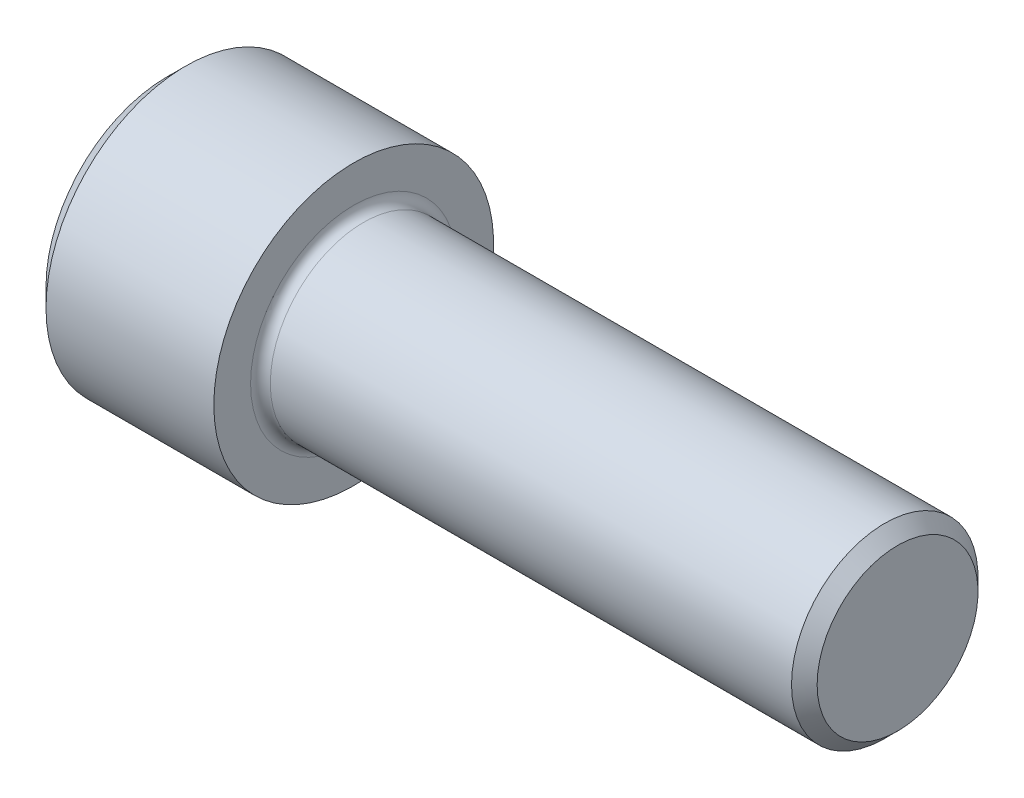
ISO-10303-21;
HEADER;
FILE_DESCRIPTION(('STEP AP214'),'2;1');
FILE_NAME('part.step','',(''),(''),'','','');
FILE_SCHEMA(('AUTOMOTIVE_DESIGN { 1 0 10303 214 1 1 1 1 }'));
ENDSEC;
DATA;
#1=APPLICATION_CONTEXT('core data for automotive mechanical design processes');
#2=APPLICATION_PROTOCOL_DEFINITION('international standard','automotive_design',2000,#1);
#3=PRODUCT_CONTEXT('',#1,'mechanical');
#4=PRODUCT('Part','Part','',(#3));
#5=PRODUCT_RELATED_PRODUCT_CATEGORY('part','',(#4));
#6=PRODUCT_DEFINITION_FORMATION('','',#4);
#7=PRODUCT_DEFINITION_CONTEXT('part definition',#1,'design');
#8=PRODUCT_DEFINITION('design','',#6,#7);
#9=PRODUCT_DEFINITION_SHAPE('','',#8);
#10=(LENGTH_UNIT() NAMED_UNIT(*) SI_UNIT(.MILLI.,.METRE.));
#11=(NAMED_UNIT(*) PLANE_ANGLE_UNIT() SI_UNIT($,.RADIAN.));
#12=(NAMED_UNIT(*) SI_UNIT($,.STERADIAN.) SOLID_ANGLE_UNIT());
#13=UNCERTAINTY_MEASURE_WITH_UNIT(LENGTH_MEASURE(1.E-05),#10,'distance_accuracy_value','');
#14=(GEOMETRIC_REPRESENTATION_CONTEXT(3) GLOBAL_UNCERTAINTY_ASSIGNED_CONTEXT((#13)) GLOBAL_UNIT_ASSIGNED_CONTEXT((#10,
#11,#12)) REPRESENTATION_CONTEXT('',''));
#15=CARTESIAN_POINT('',(0.,0.,0.));
#16=DIRECTION('',(0.,0.,1.));
#17=DIRECTION('',(1.,0.,0.));
#18=AXIS2_PLACEMENT_3D('',#15,#16,#17);
#19=CARTESIAN_POINT('',(0.,0.,0.));
#20=DIRECTION('',(-1.,0.,0.));
#21=DIRECTION('',(0.,0.,1.));
#22=AXIS2_PLACEMENT_3D('',#19,#20,#21);
#23=PLANE('',#22);
#24=DIRECTION('',(0.,-0.499999999999999,0.866025403784439));
#25=VECTOR('',#24,1.);
#26=CARTESIAN_POINT('',(0.,10.9696551146029,0.));
#27=LINE('',#26,#25);
#28=CARTESIAN_POINT('',(0.,10.9696551146029,0.));
#29=VERTEX_POINT('',#28);
#30=CARTESIAN_POINT('',(0.,5.48482755730145,9.49999999999999));
#31=VERTEX_POINT('',#30);
#32=EDGE_CURVE('E390',#29,#31,#27,.T.);
#33=ORIENTED_EDGE('',*,*,#32,.T.);
#34=DIRECTION('',(0.,1.,0.));
#35=VECTOR('',#34,1.);
#36=CARTESIAN_POINT('',(0.,-5.48482755730143,9.5));
#37=LINE('',#36,#35);
#38=CARTESIAN_POINT('',(0.,-5.48482755730143,9.5));
#39=VERTEX_POINT('',#38);
#40=EDGE_CURVE('E126',#39,#31,#37,.T.);
#41=ORIENTED_EDGE('',*,*,#40,.F.);
#42=DIRECTION('',(0.,-0.500000000000001,-0.866025403784438));
#43=VECTOR('',#42,1.);
#44=CARTESIAN_POINT('',(0.,-5.48482755730143,9.5));
#45=LINE('',#44,#43);
#46=CARTESIAN_POINT('',(0.,-10.9696551146029,0.));
#47=VERTEX_POINT('',#46);
#48=EDGE_CURVE('E393',#39,#47,#45,.T.);
#49=ORIENTED_EDGE('',*,*,#48,.T.);
#50=DIRECTION('',(0.,0.499999999999999,-0.866025403784439));
#51=VECTOR('',#50,1.);
#52=CARTESIAN_POINT('',(0.,-10.9696551146029,0.));
#53=LINE('',#52,#51);
#54=CARTESIAN_POINT('',(0.,-5.48482755730146,-9.49999999999999));
#55=VERTEX_POINT('',#54);
#56=EDGE_CURVE('E396',#47,#55,#53,.T.);
#57=ORIENTED_EDGE('',*,*,#56,.T.);
#58=DIRECTION('',(0.,-1.,0.));
#59=VECTOR('',#58,1.);
#60=CARTESIAN_POINT('',(0.,5.48482755730143,-9.50000000000001));
#61=LINE('',#60,#59);
#62=CARTESIAN_POINT('',(0.,5.48482755730143,-9.50000000000001));
#63=VERTEX_POINT('',#62);
#64=EDGE_CURVE('E399',#63,#55,#61,.T.);
#65=ORIENTED_EDGE('',*,*,#64,.F.);
#66=DIRECTION('',(0.,-0.500000000000001,-0.866025403784438));
#67=VECTOR('',#66,1.);
#68=CARTESIAN_POINT('',(0.,10.9696551146029,0.));
#69=LINE('',#68,#67);
#70=EDGE_CURVE('E121',#29,#63,#69,.T.);
#71=ORIENTED_EDGE('',*,*,#70,.F.);
#72=EDGE_LOOP('',(#33,#41,#49,#57,#65,#71));
#73=FACE_BOUND('',#72,.T.);
#74=CARTESIAN_POINT('',(0.,0.,0.));
#75=DIRECTION('',(-1.,0.,0.));
#76=DIRECTION('',(0.,0.,1.));
#77=AXIS2_PLACEMENT_3D('',#74,#75,#76);
#78=CIRCLE('',#77,15.6);
#79=CARTESIAN_POINT('',(0.,0.,15.6));
#80=VERTEX_POINT('',#79);
#81=EDGE_CURVE('E137',#80,#80,#78,.T.);
#82=ORIENTED_EDGE('',*,*,#81,.T.);
#83=EDGE_LOOP('',(#82));
#84=FACE_BOUND('',#83,.T.);
#85=ADVANCED_FACE('F34',(#73,#84),#23,.T.);
#86=CARTESIAN_POINT('',(94.,10.352,0.));
#87=DIRECTION('',(1.,0.,0.));
#88=DIRECTION('',(0.,0.,-1.));
#89=AXIS2_PLACEMENT_3D('',#86,#87,#88);
#90=PLANE('',#89);
#91=CARTESIAN_POINT('',(94.,0.,0.));
#92=DIRECTION('',(-1.,0.,0.));
#93=DIRECTION('',(0.,0.,1.));
#94=AXIS2_PLACEMENT_3D('',#91,#92,#93);
#95=CIRCLE('',#94,10.352);
#96=CARTESIAN_POINT('',(94.,0.,10.352));
#97=VERTEX_POINT('',#96);
#98=EDGE_CURVE('E150',#97,#97,#95,.T.);
#99=ORIENTED_EDGE('',*,*,#98,.F.);
#100=EDGE_LOOP('',(#99));
#101=FACE_BOUND('',#100,.T.);
#102=ADVANCED_FACE('F171',(#101),#90,.T.);
#103=CARTESIAN_POINT('',(94.,0.,0.));
#104=DIRECTION('',(-1.,0.,0.));
#105=DIRECTION('',(0.,0.,1.));
#106=AXIS2_PLACEMENT_3D('',#103,#104,#105);
#107=CONICAL_SURFACE('',#106,10.352,0.78539816339734);
#108=CARTESIAN_POINT('',(92.3519999999997,0.,0.));
#109=DIRECTION('',(-1.,0.,0.));
#110=DIRECTION('',(0.,0.,1.));
#111=AXIS2_PLACEMENT_3D('',#108,#109,#110);
#112=CIRCLE('',#111,12.);
#113=CARTESIAN_POINT('',(92.3519999999997,0.,12.));
#114=VERTEX_POINT('',#113);
#115=EDGE_CURVE('E147',#114,#114,#112,.T.);
#116=ORIENTED_EDGE('',*,*,#115,.F.);
#117=EDGE_LOOP('',(#116));
#118=FACE_BOUND('',#117,.T.);
#119=ORIENTED_EDGE('',*,*,#98,.T.);
#120=EDGE_LOOP('',(#119));
#121=FACE_BOUND('',#120,.T.);
#122=ADVANCED_FACE('F177',(#118,#121),#107,.T.);
#123=CARTESIAN_POINT('',(-31.75,0.,0.));
#124=DIRECTION('',(-1.,0.,0.));
#125=DIRECTION('',(0.,0.,1.));
#126=AXIS2_PLACEMENT_3D('',#123,#124,#125);
#127=CYLINDRICAL_SURFACE('',#126,12.);
#128=CARTESIAN_POINT('',(25.27,0.,0.));
#129=DIRECTION('',(1.,0.,0.));
#130=DIRECTION('',(0.,0.,-1.));
#131=AXIS2_PLACEMENT_3D('',#128,#129,#130);
#132=CIRCLE('',#131,12.);
#133=CARTESIAN_POINT('',(25.27,0.,-12.));
#134=VERTEX_POINT('',#133);
#135=EDGE_CURVE('E11',#134,#134,#132,.T.);
#136=ORIENTED_EDGE('',*,*,#135,.T.);
#137=EDGE_LOOP('',(#136));
#138=FACE_BOUND('',#137,.T.);
#139=ORIENTED_EDGE('',*,*,#115,.T.);
#140=EDGE_LOOP('',(#139));
#141=FACE_BOUND('',#140,.T.);
#142=ADVANCED_FACE('F188',(#138,#141),#127,.T.);
#143=CARTESIAN_POINT('',(24.,18.,0.));
#144=DIRECTION('',(1.,0.,0.));
#145=DIRECTION('',(0.,0.,-1.));
#146=AXIS2_PLACEMENT_3D('',#143,#144,#145);
#147=PLANE('',#146);
#148=CARTESIAN_POINT('',(24.,0.,0.));
#149=DIRECTION('',(1.,0.,0.));
#150=DIRECTION('',(0.,0.,-1.));
#151=AXIS2_PLACEMENT_3D('',#148,#149,#150);
#152=CIRCLE('',#151,13.27);
#153=CARTESIAN_POINT('',(24.,0.,-13.27));
#154=VERTEX_POINT('',#153);
#155=EDGE_CURVE('E42',#154,#154,#152,.F.);
#156=ORIENTED_EDGE('',*,*,#155,.T.);
#157=EDGE_LOOP('',(#156));
#158=FACE_BOUND('',#157,.T.);
#159=CARTESIAN_POINT('',(24.,0.,0.));
#160=DIRECTION('',(-1.,0.,0.));
#161=DIRECTION('',(0.,0.,1.));
#162=AXIS2_PLACEMENT_3D('',#159,#160,#161);
#163=CIRCLE('',#162,18.);
#164=CARTESIAN_POINT('',(24.,0.,18.));
#165=VERTEX_POINT('',#164);
#166=EDGE_CURVE('E144',#165,#165,#163,.T.);
#167=ORIENTED_EDGE('',*,*,#166,.F.);
#168=EDGE_LOOP('',(#167));
#169=FACE_BOUND('',#168,.T.);
#170=ADVANCED_FACE('F155',(#158,#169),#147,.T.);
#171=CARTESIAN_POINT('',(-31.75,0.,0.));
#172=DIRECTION('',(-1.,0.,0.));
#173=DIRECTION('',(0.,0.,1.));
#174=AXIS2_PLACEMENT_3D('',#171,#172,#173);
#175=CYLINDRICAL_SURFACE('',#174,18.);
#176=ORIENTED_EDGE('',*,*,#166,.T.);
#177=EDGE_LOOP('',(#176));
#178=FACE_BOUND('',#177,.T.);
#179=CARTESIAN_POINT('',(2.4,0.,0.));
#180=DIRECTION('',(-1.,0.,0.));
#181=DIRECTION('',(0.,0.,1.));
#182=AXIS2_PLACEMENT_3D('',#179,#180,#181);
#183=CIRCLE('',#182,18.);
#184=CARTESIAN_POINT('',(2.4,0.,18.));
#185=VERTEX_POINT('',#184);
#186=EDGE_CURVE('E141',#185,#185,#183,.T.);
#187=ORIENTED_EDGE('',*,*,#186,.F.);
#188=EDGE_LOOP('',(#187));
#189=FACE_BOUND('',#188,.T.);
#190=ADVANCED_FACE('F166',(#178,#189),#175,.T.);
#191=CARTESIAN_POINT('',(0.,0.,0.));
#192=DIRECTION('',(1.,0.,0.));
#193=DIRECTION('',(0.,0.,-1.));
#194=AXIS2_PLACEMENT_3D('',#191,#192,#193);
#195=CONICAL_SURFACE('',#194,15.6,0.785398163397449);
#196=ORIENTED_EDGE('',*,*,#186,.T.);
#197=EDGE_LOOP('',(#196));
#198=FACE_BOUND('',#197,.T.);
#199=ORIENTED_EDGE('',*,*,#81,.F.);
#200=EDGE_LOOP('',(#199));
#201=FACE_BOUND('',#200,.T.);
#202=ADVANCED_FACE('F159',(#198,#201),#195,.T.);
#203=CARTESIAN_POINT('',(25.27,0.,0.));
#204=DIRECTION('',(1.,0.,0.));
#205=DIRECTION('',(0.,0.,-1.));
#206=AXIS2_PLACEMENT_3D('',#203,#204,#205);
#207=TOROIDAL_SURFACE('',#206,13.27,1.27);
#208=ORIENTED_EDGE('',*,*,#135,.F.);
#209=EDGE_LOOP('',(#208));
#210=FACE_BOUND('',#209,.T.);
#211=ORIENTED_EDGE('',*,*,#155,.F.);
#212=EDGE_LOOP('',(#211));
#213=FACE_BOUND('',#212,.T.);
#214=ADVANCED_FACE('F36',(#210,#213),#207,.F.);
#215=CARTESIAN_POINT('',(12.,10.9696551146029,0.));
#216=DIRECTION('',(0.,-0.866025403784439,-0.499999999999999));
#217=DIRECTION('',(0.,0.499999999999999,-0.866025403784439));
#218=AXIS2_PLACEMENT_3D('',#215,#216,#217);
#219=PLANE('',#218);
#220=ORIENTED_EDGE('',*,*,#32,.F.);
#221=DIRECTION('',(-1.,0.,0.));
#222=VECTOR('',#221,1.);
#223=CARTESIAN_POINT('',(12.,10.9696551146029,0.));
#224=LINE('',#223,#222);
#225=CARTESIAN_POINT('',(12.,10.9696551146029,0.));
#226=VERTEX_POINT('',#225);
#227=EDGE_CURVE('E389',#226,#29,#224,.T.);
#228=ORIENTED_EDGE('',*,*,#227,.F.);
#229=DIRECTION('',(0.,-0.499999999999999,0.866025403784439));
#230=VECTOR('',#229,1.);
#231=CARTESIAN_POINT('',(12.,10.9696551146029,0.));
#232=LINE('',#231,#230);
#233=CARTESIAN_POINT('',(12.,8.22724133595217,4.74999999999999));
#234=VERTEX_POINT('',#233);
#235=EDGE_CURVE('E49',#226,#234,#232,.T.);
#236=ORIENTED_EDGE('',*,*,#235,.T.);
#237=CARTESIAN_POINT('',(12.,5.48482755730145,9.49999999999999));
#238=VERTEX_POINT('',#237);
#239=EDGE_CURVE('E107',#234,#238,#232,.T.);
#240=ORIENTED_EDGE('',*,*,#239,.T.);
#241=DIRECTION('',(-1.,0.,0.));
#242=VECTOR('',#241,1.);
#243=CARTESIAN_POINT('',(12.,5.48482755730145,9.49999999999999));
#244=LINE('',#243,#242);
#245=EDGE_CURVE('E119',#238,#31,#244,.T.);
#246=ORIENTED_EDGE('',*,*,#245,.T.);
#247=EDGE_LOOP('',(#220,#228,#236,#240,#246));
#248=FACE_BOUND('',#247,.T.);
#249=ADVANCED_FACE('F118',(#248),#219,.T.);
#250=CARTESIAN_POINT('',(12.,-5.48482755730143,9.5));
#251=DIRECTION('',(0.,0.,1.));
#252=DIRECTION('',(0.,-1.,0.));
#253=AXIS2_PLACEMENT_3D('',#250,#251,#252);
#254=PLANE('',#253);
#255=ORIENTED_EDGE('',*,*,#40,.T.);
#256=ORIENTED_EDGE('',*,*,#245,.F.);
#257=DIRECTION('',(0.,1.,0.));
#258=VECTOR('',#257,1.);
#259=CARTESIAN_POINT('',(12.,-5.48482755730143,9.5));
#260=LINE('',#259,#258);
#261=CARTESIAN_POINT('',(12.,0.,9.5));
#262=VERTEX_POINT('',#261);
#263=EDGE_CURVE('E105',#262,#238,#260,.T.);
#264=ORIENTED_EDGE('',*,*,#263,.F.);
#265=CARTESIAN_POINT('',(12.,-5.48482755730143,9.5));
#266=VERTEX_POINT('',#265);
#267=EDGE_CURVE('E115',#266,#262,#260,.T.);
#268=ORIENTED_EDGE('',*,*,#267,.F.);
#269=DIRECTION('',(-1.,0.,0.));
#270=VECTOR('',#269,1.);
#271=CARTESIAN_POINT('',(12.,-5.48482755730143,9.5));
#272=LINE('',#271,#270);
#273=EDGE_CURVE('E128',#266,#39,#272,.T.);
#274=ORIENTED_EDGE('',*,*,#273,.T.);
#275=EDGE_LOOP('',(#255,#256,#264,#268,#274));
#276=FACE_BOUND('',#275,.T.);
#277=ADVANCED_FACE('F123',(#276),#254,.F.);
#278=CARTESIAN_POINT('',(12.,-5.48482755730143,9.5));
#279=DIRECTION('',(0.,0.866025403784438,-0.500000000000001));
#280=DIRECTION('',(0.,0.500000000000001,0.866025403784438));
#281=AXIS2_PLACEMENT_3D('',#278,#279,#280);
#282=PLANE('',#281);
#283=ORIENTED_EDGE('',*,*,#48,.F.);
#284=ORIENTED_EDGE('',*,*,#273,.F.);
#285=DIRECTION('',(0.,-0.500000000000001,-0.866025403784438));
#286=VECTOR('',#285,1.);
#287=CARTESIAN_POINT('',(12.,-5.48482755730143,9.5));
#288=LINE('',#287,#286);
#289=CARTESIAN_POINT('',(12.,-8.22724133595216,4.75000000000001));
#290=VERTEX_POINT('',#289);
#291=EDGE_CURVE('E370',#266,#290,#288,.T.);
#292=ORIENTED_EDGE('',*,*,#291,.T.);
#293=CARTESIAN_POINT('',(12.,-10.9696551146029,0.));
#294=VERTEX_POINT('',#293);
#295=EDGE_CURVE('E372',#290,#294,#288,.T.);
#296=ORIENTED_EDGE('',*,*,#295,.T.);
#297=DIRECTION('',(-1.,0.,0.));
#298=VECTOR('',#297,1.);
#299=CARTESIAN_POINT('',(12.,-10.9696551146029,0.));
#300=LINE('',#299,#298);
#301=EDGE_CURVE('E133',#294,#47,#300,.T.);
#302=ORIENTED_EDGE('',*,*,#301,.T.);
#303=EDGE_LOOP('',(#283,#284,#292,#296,#302));
#304=FACE_BOUND('',#303,.T.);
#305=ADVANCED_FACE('F262',(#304),#282,.T.);
#306=CARTESIAN_POINT('',(12.,-10.9696551146029,0.));
#307=DIRECTION('',(0.,0.866025403784439,0.499999999999999));
#308=DIRECTION('',(0.,-0.499999999999999,0.866025403784439));
#309=AXIS2_PLACEMENT_3D('',#306,#307,#308);
#310=PLANE('',#309);
#311=ORIENTED_EDGE('',*,*,#56,.F.);
#312=ORIENTED_EDGE('',*,*,#301,.F.);
#313=DIRECTION('',(0.,0.499999999999999,-0.866025403784439));
#314=VECTOR('',#313,1.);
#315=CARTESIAN_POINT('',(12.,-10.9696551146029,0.));
#316=LINE('',#315,#314);
#317=CARTESIAN_POINT('',(12.,-8.22724133595218,-4.74999999999999));
#318=VERTEX_POINT('',#317);
#319=EDGE_CURVE('E375',#294,#318,#316,.T.);
#320=ORIENTED_EDGE('',*,*,#319,.T.);
#321=CARTESIAN_POINT('',(12.,-5.48482755730146,-9.49999999999999));
#322=VERTEX_POINT('',#321);
#323=EDGE_CURVE('E379',#318,#322,#316,.T.);
#324=ORIENTED_EDGE('',*,*,#323,.T.);
#325=DIRECTION('',(-1.,0.,0.));
#326=VECTOR('',#325,1.);
#327=CARTESIAN_POINT('',(12.,-5.48482755730146,-9.49999999999999));
#328=LINE('',#327,#326);
#329=EDGE_CURVE('E408',#322,#55,#328,.T.);
#330=ORIENTED_EDGE('',*,*,#329,.T.);
#331=EDGE_LOOP('',(#311,#312,#320,#324,#330));
#332=FACE_BOUND('',#331,.T.);
#333=ADVANCED_FACE('F270',(#332),#310,.T.);
#334=CARTESIAN_POINT('',(12.,5.48482755730143,-9.50000000000001));
#335=DIRECTION('',(0.,0.,-1.));
#336=DIRECTION('',(0.,1.,0.));
#337=AXIS2_PLACEMENT_3D('',#334,#335,#336);
#338=PLANE('',#337);
#339=ORIENTED_EDGE('',*,*,#64,.T.);
#340=ORIENTED_EDGE('',*,*,#329,.F.);
#341=DIRECTION('',(0.,-1.,0.));
#342=VECTOR('',#341,1.);
#343=CARTESIAN_POINT('',(12.,5.48482755730143,-9.50000000000001));
#344=LINE('',#343,#342);
#345=CARTESIAN_POINT('',(12.,0.,-9.5));
#346=VERTEX_POINT('',#345);
#347=EDGE_CURVE('E383',#346,#322,#344,.T.);
#348=ORIENTED_EDGE('',*,*,#347,.F.);
#349=CARTESIAN_POINT('',(12.,5.48482755730143,-9.50000000000001));
#350=VERTEX_POINT('',#349);
#351=EDGE_CURVE('E384',#350,#346,#344,.T.);
#352=ORIENTED_EDGE('',*,*,#351,.F.);
#353=DIRECTION('',(-1.,0.,0.));
#354=VECTOR('',#353,1.);
#355=CARTESIAN_POINT('',(12.,5.48482755730143,-9.50000000000001));
#356=LINE('',#355,#354);
#357=EDGE_CURVE('E405',#350,#63,#356,.T.);
#358=ORIENTED_EDGE('',*,*,#357,.T.);
#359=EDGE_LOOP('',(#339,#340,#348,#352,#358));
#360=FACE_BOUND('',#359,.T.);
#361=ADVANCED_FACE('F279',(#360),#338,.F.);
#362=CARTESIAN_POINT('',(12.,10.9696551146029,0.));
#363=DIRECTION('',(0.,0.866025403784438,-0.500000000000001));
#364=DIRECTION('',(0.,0.500000000000001,0.866025403784438));
#365=AXIS2_PLACEMENT_3D('',#362,#363,#364);
#366=PLANE('',#365);
#367=ORIENTED_EDGE('',*,*,#70,.T.);
#368=ORIENTED_EDGE('',*,*,#357,.F.);
#369=DIRECTION('',(0.,-0.500000000000001,-0.866025403784438));
#370=VECTOR('',#369,1.);
#371=CARTESIAN_POINT('',(12.,10.9696551146029,0.));
#372=LINE('',#371,#370);
#373=CARTESIAN_POINT('',(12.,8.22724133595216,-4.75000000000001));
#374=VERTEX_POINT('',#373);
#375=EDGE_CURVE('E387',#374,#350,#372,.T.);
#376=ORIENTED_EDGE('',*,*,#375,.F.);
#377=EDGE_CURVE('E361',#226,#374,#372,.T.);
#378=ORIENTED_EDGE('',*,*,#377,.F.);
#379=ORIENTED_EDGE('',*,*,#227,.T.);
#380=EDGE_LOOP('',(#367,#368,#376,#378,#379));
#381=FACE_BOUND('',#380,.T.);
#382=ADVANCED_FACE('F288',(#381),#366,.F.);
#383=CARTESIAN_POINT('',(12.,5.48482755730145,9.49999999999999));
#384=DIRECTION('',(-1.,0.,0.));
#385=DIRECTION('',(0.,0.,1.));
#386=AXIS2_PLACEMENT_3D('',#383,#384,#385);
#387=PLANE('',#386);
#388=CARTESIAN_POINT('',(12.,0.,0.));
#389=DIRECTION('',(-1.,0.,0.));
#390=DIRECTION('',(0.,0.,1.));
#391=AXIS2_PLACEMENT_3D('',#388,#389,#390);
#392=CIRCLE('',#391,9.5);
#393=EDGE_CURVE('E127',#290,#262,#392,.T.);
#394=ORIENTED_EDGE('',*,*,#393,.F.);
#395=ORIENTED_EDGE('',*,*,#291,.F.);
#396=ORIENTED_EDGE('',*,*,#267,.T.);
#397=EDGE_LOOP('',(#394,#395,#396));
#398=FACE_BOUND('',#397,.T.);
#399=ADVANCED_FACE('F297',(#398),#387,.T.);
#400=EDGE_CURVE('E131',#318,#290,#392,.T.);
#401=ORIENTED_EDGE('',*,*,#400,.F.);
#402=ORIENTED_EDGE('',*,*,#319,.F.);
#403=ORIENTED_EDGE('',*,*,#295,.F.);
#404=EDGE_LOOP('',(#401,#402,#403));
#405=FACE_BOUND('',#404,.T.);
#406=ADVANCED_FACE('F306',(#405),#387,.T.);
#407=EDGE_CURVE('E414',#346,#318,#392,.T.);
#408=ORIENTED_EDGE('',*,*,#407,.F.);
#409=ORIENTED_EDGE('',*,*,#347,.T.);
#410=ORIENTED_EDGE('',*,*,#323,.F.);
#411=EDGE_LOOP('',(#408,#409,#410));
#412=FACE_BOUND('',#411,.T.);
#413=ADVANCED_FACE('F315',(#412),#387,.T.);
#414=EDGE_CURVE('E364',#374,#346,#392,.T.);
#415=ORIENTED_EDGE('',*,*,#414,.F.);
#416=ORIENTED_EDGE('',*,*,#375,.T.);
#417=ORIENTED_EDGE('',*,*,#351,.T.);
#418=EDGE_LOOP('',(#415,#416,#417));
#419=FACE_BOUND('',#418,.T.);
#420=ADVANCED_FACE('F323',(#419),#387,.T.);
#421=EDGE_CURVE('E138',#234,#374,#392,.T.);
#422=ORIENTED_EDGE('',*,*,#421,.F.);
#423=ORIENTED_EDGE('',*,*,#235,.F.);
#424=ORIENTED_EDGE('',*,*,#377,.T.);
#425=EDGE_LOOP('',(#422,#423,#424));
#426=FACE_BOUND('',#425,.T.);
#427=ADVANCED_FACE('F331',(#426),#387,.T.);
#428=EDGE_CURVE('E110',#262,#234,#392,.T.);
#429=ORIENTED_EDGE('',*,*,#428,.F.);
#430=ORIENTED_EDGE('',*,*,#263,.T.);
#431=ORIENTED_EDGE('',*,*,#239,.F.);
#432=EDGE_LOOP('',(#429,#430,#431));
#433=FACE_BOUND('',#432,.T.);
#434=ADVANCED_FACE('F106',(#433),#387,.T.);
#435=CARTESIAN_POINT('',(12.,0.,0.));
#436=DIRECTION('',(-1.,0.,0.));
#437=DIRECTION('',(0.,0.,1.));
#438=AXIS2_PLACEMENT_3D('',#435,#436,#437);
#439=CONICAL_SURFACE('',#438,9.5,1.04719755119659);
#440=CARTESIAN_POINT('',(17.4848275573015,0.,0.));
#441=VERTEX_POINT('',#440);
#442=VERTEX_LOOP('',#441);
#443=FACE_BOUND('',#442,.T.);
#444=ORIENTED_EDGE('',*,*,#428,.T.);
#445=ORIENTED_EDGE('',*,*,#421,.T.);
#446=ORIENTED_EDGE('',*,*,#414,.T.);
#447=ORIENTED_EDGE('',*,*,#407,.T.);
#448=ORIENTED_EDGE('',*,*,#400,.T.);
#449=ORIENTED_EDGE('',*,*,#393,.T.);
#450=EDGE_LOOP('',(#444,#445,#446,#447,#448,#449));
#451=FACE_BOUND('',#450,.T.);
#452=ADVANCED_FACE('F181',(#443,#451),#439,.F.);
#453=CLOSED_SHELL('',(#85,#102,#122,#142,#170,#190,#202,#214,#249,#277,#305,#333,#361,#382,#399,
#406,#413,#420,#427,#434,#452));
#454=MANIFOLD_SOLID_BREP('B2',#453);
#455=ADVANCED_BREP_SHAPE_REPRESENTATION('',(#18,#454),#14);
#456=SHAPE_DEFINITION_REPRESENTATION(#9,#455);
ENDSEC;
END-ISO-10303-21;
